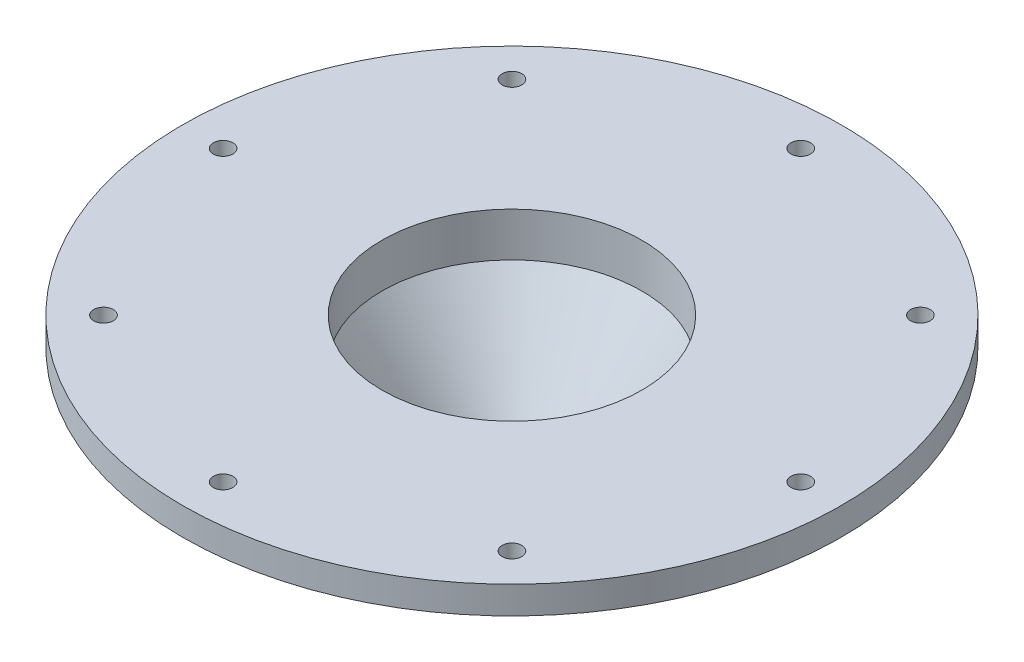
ISO-10303-21;
HEADER;
FILE_DESCRIPTION(('STEP AP214'),'2;1');
FILE_NAME('part.step','',(''),(''),'','','');
FILE_SCHEMA(('AUTOMOTIVE_DESIGN { 1 0 10303 214 1 1 1 1 }'));
ENDSEC;
DATA;
#1=APPLICATION_CONTEXT('core data for automotive mechanical design processes');
#2=APPLICATION_PROTOCOL_DEFINITION('international standard','automotive_design',2000,#1);
#3=PRODUCT_CONTEXT('',#1,'mechanical');
#4=PRODUCT('Part','Part','',(#3));
#5=PRODUCT_RELATED_PRODUCT_CATEGORY('part','',(#4));
#6=PRODUCT_DEFINITION_FORMATION('','',#4);
#7=PRODUCT_DEFINITION_CONTEXT('part definition',#1,'design');
#8=PRODUCT_DEFINITION('design','',#6,#7);
#9=PRODUCT_DEFINITION_SHAPE('','',#8);
#10=(LENGTH_UNIT() NAMED_UNIT(*) SI_UNIT(.MILLI.,.METRE.));
#11=(NAMED_UNIT(*) PLANE_ANGLE_UNIT() SI_UNIT($,.RADIAN.));
#12=(NAMED_UNIT(*) SI_UNIT($,.STERADIAN.) SOLID_ANGLE_UNIT());
#13=UNCERTAINTY_MEASURE_WITH_UNIT(LENGTH_MEASURE(1.E-05),#10,'distance_accuracy_value','');
#14=(GEOMETRIC_REPRESENTATION_CONTEXT(3) GLOBAL_UNCERTAINTY_ASSIGNED_CONTEXT((#13)) GLOBAL_UNIT_ASSIGNED_CONTEXT((#10,
#11,#12)) REPRESENTATION_CONTEXT('',''));
#15=CARTESIAN_POINT('',(0.,0.,0.));
#16=DIRECTION('',(0.,0.,1.));
#17=DIRECTION('',(1.,0.,0.));
#18=AXIS2_PLACEMENT_3D('',#15,#16,#17);
#19=CARTESIAN_POINT('',(0.,-19.05,0.));
#20=DIRECTION('',(0.,-1.,0.));
#21=DIRECTION('',(0.,0.,-1.));
#22=AXIS2_PLACEMENT_3D('',#19,#20,#21);
#23=PLANE('',#22);
#24=CARTESIAN_POINT('',(0.,-19.05,0.));
#25=DIRECTION('',(0.,-1.,0.));
#26=DIRECTION('',(0.,0.,-1.));
#27=AXIS2_PLACEMENT_3D('',#24,#25,#26);
#28=CIRCLE('',#27,5.);
#29=CARTESIAN_POINT('',(0.,-19.05,-5.));
#30=VERTEX_POINT('',#29);
#31=EDGE_CURVE('E55',#30,#30,#28,.T.);
#32=ORIENTED_EDGE('',*,*,#31,.F.);
#33=EDGE_LOOP('',(#32));
#34=FACE_BOUND('',#33,.T.);
#35=CARTESIAN_POINT('',(0.,-19.05,0.));
#36=DIRECTION('',(0.,1.,0.));
#37=DIRECTION('',(-1.,0.,0.));
#38=AXIS2_PLACEMENT_3D('',#35,#36,#37);
#39=CIRCLE('',#38,8.41515202607263);
#40=CARTESIAN_POINT('',(-8.41515202607263,-19.05,0.));
#41=VERTEX_POINT('',#40);
#42=EDGE_CURVE('E165',#41,#41,#39,.T.);
#43=ORIENTED_EDGE('',*,*,#42,.F.);
#44=EDGE_LOOP('',(#43));
#45=FACE_BOUND('',#44,.T.);
#46=ADVANCED_FACE('F36',(#34,#45),#23,.T.);
#47=CARTESIAN_POINT('',(0.,3.175,0.));
#48=DIRECTION('',(0.,-1.,0.));
#49=DIRECTION('',(0.,0.,-1.));
#50=AXIS2_PLACEMENT_3D('',#47,#48,#49);
#51=CYLINDRICAL_SURFACE('',#50,5.);
#52=CARTESIAN_POINT('',(0.,-15.875,0.));
#53=DIRECTION('',(0.,-1.,0.));
#54=DIRECTION('',(0.,0.,-1.));
#55=AXIS2_PLACEMENT_3D('',#52,#53,#54);
#56=CIRCLE('',#55,5.);
#57=CARTESIAN_POINT('',(-1.36585362623204,-15.875,4.80982784221107));
#58=VERTEX_POINT('',#57);
#59=EDGE_CURVE('E64',#58,#58,#56,.T.);
#60=ORIENTED_EDGE('',*,*,#59,.F.);
#61=EDGE_LOOP('',(#60));
#62=FACE_BOUND('',#61,.T.);
#63=ORIENTED_EDGE('',*,*,#31,.T.);
#64=EDGE_LOOP('',(#63));
#65=FACE_BOUND('',#64,.T.);
#66=ADVANCED_FACE('F70',(#62,#65),#51,.F.);
#67=CARTESIAN_POINT('',(0.,0.,0.));
#68=DIRECTION('',(0.,1.,0.));
#69=DIRECTION('',(0.,0.,1.));
#70=AXIS2_PLACEMENT_3D('',#67,#68,#69);
#71=PLANE('',#70);
#72=CARTESIAN_POINT('',(-23.5731723178062,0.,23.5731723178068));
#73=DIRECTION('',(0.,-1.,0.));
#74=DIRECTION('',(0.,0.,-1.));
#75=AXIS2_PLACEMENT_3D('',#72,#73,#74);
#76=CIRCLE('',#75,1.13029999999999);
#77=CARTESIAN_POINT('',(-23.5731723178062,0.,22.4428723178068));
#78=VERTEX_POINT('',#77);
#79=EDGE_CURVE('E58',#78,#78,#76,.T.);
#80=ORIENTED_EDGE('',*,*,#79,.F.);
#81=EDGE_LOOP('',(#80));
#82=FACE_BOUND('',#81,.T.);
#83=CARTESIAN_POINT('',(-33.3375,0.,3.49191777401049E-13));
#84=DIRECTION('',(0.,-1.,0.));
#85=DIRECTION('',(0.,0.,-1.));
#86=AXIS2_PLACEMENT_3D('',#83,#84,#85);
#87=CIRCLE('',#86,1.13029999999999);
#88=CARTESIAN_POINT('',(-33.3375,0.,-1.13029999999964));
#89=VERTEX_POINT('',#88);
#90=EDGE_CURVE('E134',#89,#89,#87,.T.);
#91=ORIENTED_EDGE('',*,*,#90,.F.);
#92=EDGE_LOOP('',(#91));
#93=FACE_BOUND('',#92,.T.);
#94=CARTESIAN_POINT('',(0.,0.,-33.3375));
#95=DIRECTION('',(0.,-1.,0.));
#96=DIRECTION('',(0.,0.,-1.));
#97=AXIS2_PLACEMENT_3D('',#94,#95,#96);
#98=CIRCLE('',#97,1.13029999999999);
#99=CARTESIAN_POINT('',(0.,0.,-34.4678));
#100=VERTEX_POINT('',#99);
#101=EDGE_CURVE('E138',#100,#100,#98,.T.);
#102=ORIENTED_EDGE('',*,*,#101,.F.);
#103=EDGE_LOOP('',(#102));
#104=FACE_BOUND('',#103,.T.);
#105=CARTESIAN_POINT('',(23.5731723178064,0.,-23.5731723178067));
#106=DIRECTION('',(0.,-1.,0.));
#107=DIRECTION('',(0.,0.,-1.));
#108=AXIS2_PLACEMENT_3D('',#105,#106,#107);
#109=CIRCLE('',#108,1.13029999999999);
#110=CARTESIAN_POINT('',(23.5731723178064,0.,-24.7034723178066));
#111=VERTEX_POINT('',#110);
#112=EDGE_CURVE('E142',#111,#111,#109,.T.);
#113=ORIENTED_EDGE('',*,*,#112,.F.);
#114=EDGE_LOOP('',(#113));
#115=FACE_BOUND('',#114,.T.);
#116=CARTESIAN_POINT('',(33.3375,0.,-1.16397259133683E-13));
#117=DIRECTION('',(0.,-1.,0.));
#118=DIRECTION('',(0.,0.,-1.));
#119=AXIS2_PLACEMENT_3D('',#116,#117,#118);
#120=CIRCLE('',#119,1.13029999999999);
#121=CARTESIAN_POINT('',(33.3375,0.,-1.1303000000001));
#122=VERTEX_POINT('',#121);
#123=EDGE_CURVE('E146',#122,#122,#120,.T.);
#124=ORIENTED_EDGE('',*,*,#123,.F.);
#125=EDGE_LOOP('',(#124));
#126=FACE_BOUND('',#125,.T.);
#127=CARTESIAN_POINT('',(23.5731723178066,0.,23.5731723178065));
#128=DIRECTION('',(0.,-1.,0.));
#129=DIRECTION('',(0.,0.,-1.));
#130=AXIS2_PLACEMENT_3D('',#127,#128,#129);
#131=CIRCLE('',#130,1.13029999999999);
#132=CARTESIAN_POINT('',(23.5731723178066,0.,22.4428723178065));
#133=VERTEX_POINT('',#132);
#134=EDGE_CURVE('E150',#133,#133,#131,.T.);
#135=ORIENTED_EDGE('',*,*,#134,.F.);
#136=EDGE_LOOP('',(#135));
#137=FACE_BOUND('',#136,.T.);
#138=CARTESIAN_POINT('',(0.,0.,33.3375));
#139=DIRECTION('',(0.,-1.,0.));
#140=DIRECTION('',(0.,0.,-1.));
#141=AXIS2_PLACEMENT_3D('',#138,#139,#140);
#142=CIRCLE('',#141,1.13029999999999);
#143=CARTESIAN_POINT('',(0.,0.,32.2072));
#144=VERTEX_POINT('',#143);
#145=EDGE_CURVE('E154',#144,#144,#142,.T.);
#146=ORIENTED_EDGE('',*,*,#145,.F.);
#147=EDGE_LOOP('',(#146));
#148=FACE_BOUND('',#147,.T.);
#149=CARTESIAN_POINT('',(0.,0.,0.));
#150=DIRECTION('',(0.,1.,0.));
#151=DIRECTION('',(0.,0.,1.));
#152=AXIS2_PLACEMENT_3D('',#149,#150,#151);
#153=CIRCLE('',#152,38.04031);
#154=CARTESIAN_POINT('',(0.,0.,38.04031));
#155=VERTEX_POINT('',#154);
#156=EDGE_CURVE('E45',#155,#155,#153,.T.);
#157=ORIENTED_EDGE('',*,*,#156,.F.);
#158=EDGE_LOOP('',(#157));
#159=FACE_BOUND('',#158,.T.);
#160=CARTESIAN_POINT('',(-23.5731723178067,0.,-23.5731723178063));
#161=DIRECTION('',(0.,-1.,0.));
#162=DIRECTION('',(0.,0.,-1.));
#163=AXIS2_PLACEMENT_3D('',#160,#161,#162);
#164=CIRCLE('',#163,1.13029999999999);
#165=CARTESIAN_POINT('',(-23.5731723178067,0.,-24.7034723178063));
#166=VERTEX_POINT('',#165);
#167=EDGE_CURVE('E160',#166,#166,#164,.T.);
#168=ORIENTED_EDGE('',*,*,#167,.F.);
#169=EDGE_LOOP('',(#168));
#170=FACE_BOUND('',#169,.T.);
#171=CARTESIAN_POINT('',(0.,0.,0.));
#172=DIRECTION('',(0.,1.,0.));
#173=DIRECTION('',(-1.,0.,0.));
#174=AXIS2_PLACEMENT_3D('',#171,#172,#173);
#175=CIRCLE('',#174,24.4);
#176=CARTESIAN_POINT('',(-24.4,0.,0.));
#177=VERTEX_POINT('',#176);
#178=EDGE_CURVE('E163',#177,#177,#175,.T.);
#179=ORIENTED_EDGE('',*,*,#178,.T.);
#180=EDGE_LOOP('',(#179));
#181=FACE_BOUND('',#180,.T.);
#182=ADVANCED_FACE('F80',(#82,#93,#104,#115,#126,#137,#148,#159,#170,#181),#71,.F.);
#183=CARTESIAN_POINT('',(0.,3.175,0.));
#184=DIRECTION('',(0.,-1.,0.));
#185=DIRECTION('',(0.,0.,-1.));
#186=AXIS2_PLACEMENT_3D('',#183,#184,#185);
#187=CYLINDRICAL_SURFACE('',#186,38.04031);
#188=CARTESIAN_POINT('',(0.,3.175,0.));
#189=DIRECTION('',(0.,1.,0.));
#190=DIRECTION('',(0.,0.,1.));
#191=AXIS2_PLACEMENT_3D('',#188,#189,#190);
#192=CIRCLE('',#191,38.04031);
#193=CARTESIAN_POINT('',(0.,3.175,38.04031));
#194=VERTEX_POINT('',#193);
#195=EDGE_CURVE('E11',#194,#194,#192,.T.);
#196=ORIENTED_EDGE('',*,*,#195,.F.);
#197=EDGE_LOOP('',(#196));
#198=FACE_BOUND('',#197,.T.);
#199=ORIENTED_EDGE('',*,*,#156,.T.);
#200=EDGE_LOOP('',(#199));
#201=FACE_BOUND('',#200,.T.);
#202=ADVANCED_FACE('F38',(#198,#201),#187,.T.);
#203=CARTESIAN_POINT('',(0.,3.175,0.));
#204=DIRECTION('',(0.,1.,0.));
#205=DIRECTION('',(0.,0.,1.));
#206=AXIS2_PLACEMENT_3D('',#203,#204,#205);
#207=PLANE('',#206);
#208=CARTESIAN_POINT('',(0.,3.175,0.));
#209=DIRECTION('',(0.,1.,0.));
#210=DIRECTION('',(0.,0.,1.));
#211=AXIS2_PLACEMENT_3D('',#208,#209,#210);
#212=CIRCLE('',#211,15.);
#213=CARTESIAN_POINT('',(0.,3.175,15.));
#214=VERTEX_POINT('',#213);
#215=EDGE_CURVE('E59',#214,#214,#212,.T.);
#216=ORIENTED_EDGE('',*,*,#215,.F.);
#217=EDGE_LOOP('',(#216));
#218=FACE_BOUND('',#217,.T.);
#219=CARTESIAN_POINT('',(-23.5731723178062,3.175,23.5731723178068));
#220=DIRECTION('',(0.,-1.,0.));
#221=DIRECTION('',(0.,0.,-1.));
#222=AXIS2_PLACEMENT_3D('',#219,#220,#221);
#223=CIRCLE('',#222,1.1303);
#224=CARTESIAN_POINT('',(-23.5731723178062,3.175,22.4428723178068));
#225=VERTEX_POINT('',#224);
#226=EDGE_CURVE('E210',#225,#225,#223,.T.);
#227=ORIENTED_EDGE('',*,*,#226,.T.);
#228=EDGE_LOOP('',(#227));
#229=FACE_BOUND('',#228,.T.);
#230=CARTESIAN_POINT('',(-33.3375,3.175,3.49191777401049E-13));
#231=DIRECTION('',(0.,-1.,0.));
#232=DIRECTION('',(0.,0.,-1.));
#233=AXIS2_PLACEMENT_3D('',#230,#231,#232);
#234=CIRCLE('',#233,1.1303);
#235=CARTESIAN_POINT('',(-33.3375,3.175,-1.13029999999965));
#236=VERTEX_POINT('',#235);
#237=EDGE_CURVE('E214',#236,#236,#234,.T.);
#238=ORIENTED_EDGE('',*,*,#237,.T.);
#239=EDGE_LOOP('',(#238));
#240=FACE_BOUND('',#239,.T.);
#241=CARTESIAN_POINT('',(-23.5731723178067,3.175,-23.5731723178063));
#242=DIRECTION('',(0.,-1.,0.));
#243=DIRECTION('',(0.,0.,-1.));
#244=AXIS2_PLACEMENT_3D('',#241,#242,#243);
#245=CIRCLE('',#244,1.1303);
#246=CARTESIAN_POINT('',(-23.5731723178067,3.175,-24.7034723178063));
#247=VERTEX_POINT('',#246);
#248=EDGE_CURVE('E218',#247,#247,#245,.T.);
#249=ORIENTED_EDGE('',*,*,#248,.T.);
#250=EDGE_LOOP('',(#249));
#251=FACE_BOUND('',#250,.T.);
#252=CARTESIAN_POINT('',(0.,3.175,-33.3375));
#253=DIRECTION('',(0.,-1.,0.));
#254=DIRECTION('',(0.,0.,-1.));
#255=AXIS2_PLACEMENT_3D('',#252,#253,#254);
#256=CIRCLE('',#255,1.1303);
#257=CARTESIAN_POINT('',(0.,3.175,-34.4678));
#258=VERTEX_POINT('',#257);
#259=EDGE_CURVE('E222',#258,#258,#256,.T.);
#260=ORIENTED_EDGE('',*,*,#259,.T.);
#261=EDGE_LOOP('',(#260));
#262=FACE_BOUND('',#261,.T.);
#263=CARTESIAN_POINT('',(23.5731723178064,3.175,-23.5731723178067));
#264=DIRECTION('',(0.,-1.,0.));
#265=DIRECTION('',(0.,0.,-1.));
#266=AXIS2_PLACEMENT_3D('',#263,#264,#265);
#267=CIRCLE('',#266,1.1303);
#268=CARTESIAN_POINT('',(23.5731723178064,3.175,-24.7034723178067));
#269=VERTEX_POINT('',#268);
#270=EDGE_CURVE('E226',#269,#269,#267,.T.);
#271=ORIENTED_EDGE('',*,*,#270,.T.);
#272=EDGE_LOOP('',(#271));
#273=FACE_BOUND('',#272,.T.);
#274=CARTESIAN_POINT('',(33.3375,3.175,-1.16397259133683E-13));
#275=DIRECTION('',(0.,-1.,0.));
#276=DIRECTION('',(0.,0.,-1.));
#277=AXIS2_PLACEMENT_3D('',#274,#275,#276);
#278=CIRCLE('',#277,1.1303);
#279=CARTESIAN_POINT('',(33.3375,3.175,-1.13030000000012));
#280=VERTEX_POINT('',#279);
#281=EDGE_CURVE('E230',#280,#280,#278,.T.);
#282=ORIENTED_EDGE('',*,*,#281,.T.);
#283=EDGE_LOOP('',(#282));
#284=FACE_BOUND('',#283,.T.);
#285=CARTESIAN_POINT('',(23.5731723178066,3.175,23.5731723178065));
#286=DIRECTION('',(0.,-1.,0.));
#287=DIRECTION('',(0.,0.,-1.));
#288=AXIS2_PLACEMENT_3D('',#285,#286,#287);
#289=CIRCLE('',#288,1.1303);
#290=CARTESIAN_POINT('',(23.5731723178066,3.175,22.4428723178065));
#291=VERTEX_POINT('',#290);
#292=EDGE_CURVE('E234',#291,#291,#289,.T.);
#293=ORIENTED_EDGE('',*,*,#292,.T.);
#294=EDGE_LOOP('',(#293));
#295=FACE_BOUND('',#294,.T.);
#296=CARTESIAN_POINT('',(0.,3.175,33.3375));
#297=DIRECTION('',(0.,-1.,0.));
#298=DIRECTION('',(0.,0.,-1.));
#299=AXIS2_PLACEMENT_3D('',#296,#297,#298);
#300=CIRCLE('',#299,1.1303);
#301=CARTESIAN_POINT('',(0.,3.175,32.2072));
#302=VERTEX_POINT('',#301);
#303=EDGE_CURVE('E50',#302,#302,#300,.T.);
#304=ORIENTED_EDGE('',*,*,#303,.T.);
#305=EDGE_LOOP('',(#304));
#306=FACE_BOUND('',#305,.T.);
#307=ORIENTED_EDGE('',*,*,#195,.T.);
#308=EDGE_LOOP('',(#307));
#309=FACE_BOUND('',#308,.T.);
#310=ADVANCED_FACE('F118',(#218,#229,#240,#251,#262,#273,#284,#295,#306,#309),#207,.T.);
#311=CARTESIAN_POINT('',(0.,0.,33.3375));
#312=DIRECTION('',(0.,-1.,0.));
#313=DIRECTION('',(0.,0.,-1.));
#314=AXIS2_PLACEMENT_3D('',#311,#312,#313);
#315=CYLINDRICAL_SURFACE('',#314,1.13029999999999);
#316=ORIENTED_EDGE('',*,*,#303,.F.);
#317=EDGE_LOOP('',(#316));
#318=FACE_BOUND('',#317,.T.);
#319=ORIENTED_EDGE('',*,*,#145,.T.);
#320=EDGE_LOOP('',(#319));
#321=FACE_BOUND('',#320,.T.);
#322=ADVANCED_FACE('F114',(#318,#321),#315,.F.);
#323=CARTESIAN_POINT('',(23.5731723178066,0.,23.5731723178065));
#324=DIRECTION('',(0.,-1.,0.));
#325=DIRECTION('',(0.,0.,-1.));
#326=AXIS2_PLACEMENT_3D('',#323,#324,#325);
#327=CYLINDRICAL_SURFACE('',#326,1.13029999999999);
#328=ORIENTED_EDGE('',*,*,#292,.F.);
#329=EDGE_LOOP('',(#328));
#330=FACE_BOUND('',#329,.T.);
#331=ORIENTED_EDGE('',*,*,#134,.T.);
#332=EDGE_LOOP('',(#331));
#333=FACE_BOUND('',#332,.T.);
#334=ADVANCED_FACE('F110',(#330,#333),#327,.F.);
#335=CARTESIAN_POINT('',(33.3375,0.,-1.16397259133683E-13));
#336=DIRECTION('',(0.,-1.,0.));
#337=DIRECTION('',(0.,0.,-1.));
#338=AXIS2_PLACEMENT_3D('',#335,#336,#337);
#339=CYLINDRICAL_SURFACE('',#338,1.13029999999999);
#340=ORIENTED_EDGE('',*,*,#281,.F.);
#341=EDGE_LOOP('',(#340));
#342=FACE_BOUND('',#341,.T.);
#343=ORIENTED_EDGE('',*,*,#123,.T.);
#344=EDGE_LOOP('',(#343));
#345=FACE_BOUND('',#344,.T.);
#346=ADVANCED_FACE('F106',(#342,#345),#339,.F.);
#347=CARTESIAN_POINT('',(23.5731723178064,0.,-23.5731723178067));
#348=DIRECTION('',(0.,-1.,0.));
#349=DIRECTION('',(0.,0.,-1.));
#350=AXIS2_PLACEMENT_3D('',#347,#348,#349);
#351=CYLINDRICAL_SURFACE('',#350,1.13029999999999);
#352=ORIENTED_EDGE('',*,*,#270,.F.);
#353=EDGE_LOOP('',(#352));
#354=FACE_BOUND('',#353,.T.);
#355=ORIENTED_EDGE('',*,*,#112,.T.);
#356=EDGE_LOOP('',(#355));
#357=FACE_BOUND('',#356,.T.);
#358=ADVANCED_FACE('F102',(#354,#357),#351,.F.);
#359=CARTESIAN_POINT('',(0.,0.,-33.3375));
#360=DIRECTION('',(0.,-1.,0.));
#361=DIRECTION('',(0.,0.,-1.));
#362=AXIS2_PLACEMENT_3D('',#359,#360,#361);
#363=CYLINDRICAL_SURFACE('',#362,1.13029999999999);
#364=ORIENTED_EDGE('',*,*,#259,.F.);
#365=EDGE_LOOP('',(#364));
#366=FACE_BOUND('',#365,.T.);
#367=ORIENTED_EDGE('',*,*,#101,.T.);
#368=EDGE_LOOP('',(#367));
#369=FACE_BOUND('',#368,.T.);
#370=ADVANCED_FACE('F98',(#366,#369),#363,.F.);
#371=CARTESIAN_POINT('',(-23.5731723178067,0.,-23.5731723178063));
#372=DIRECTION('',(0.,-1.,0.));
#373=DIRECTION('',(0.,0.,-1.));
#374=AXIS2_PLACEMENT_3D('',#371,#372,#373);
#375=CYLINDRICAL_SURFACE('',#374,1.13029999999999);
#376=ORIENTED_EDGE('',*,*,#248,.F.);
#377=EDGE_LOOP('',(#376));
#378=FACE_BOUND('',#377,.T.);
#379=ORIENTED_EDGE('',*,*,#167,.T.);
#380=EDGE_LOOP('',(#379));
#381=FACE_BOUND('',#380,.T.);
#382=ADVANCED_FACE('F94',(#378,#381),#375,.F.);
#383=CARTESIAN_POINT('',(-33.3375,0.,3.49191777401049E-13));
#384=DIRECTION('',(0.,-1.,0.));
#385=DIRECTION('',(0.,0.,-1.));
#386=AXIS2_PLACEMENT_3D('',#383,#384,#385);
#387=CYLINDRICAL_SURFACE('',#386,1.13029999999999);
#388=ORIENTED_EDGE('',*,*,#237,.F.);
#389=EDGE_LOOP('',(#388));
#390=FACE_BOUND('',#389,.T.);
#391=ORIENTED_EDGE('',*,*,#90,.T.);
#392=EDGE_LOOP('',(#391));
#393=FACE_BOUND('',#392,.T.);
#394=ADVANCED_FACE('F90',(#390,#393),#387,.F.);
#395=CARTESIAN_POINT('',(-23.5731723178062,0.,23.5731723178068));
#396=DIRECTION('',(0.,-1.,0.));
#397=DIRECTION('',(0.,0.,-1.));
#398=AXIS2_PLACEMENT_3D('',#395,#396,#397);
#399=CYLINDRICAL_SURFACE('',#398,1.13029999999999);
#400=ORIENTED_EDGE('',*,*,#226,.F.);
#401=EDGE_LOOP('',(#400));
#402=FACE_BOUND('',#401,.T.);
#403=ORIENTED_EDGE('',*,*,#79,.T.);
#404=EDGE_LOOP('',(#403));
#405=FACE_BOUND('',#404,.T.);
#406=ADVANCED_FACE('F87',(#402,#405),#399,.F.);
#407=CARTESIAN_POINT('',(0.,-1.905,0.));
#408=DIRECTION('',(0.,1.,0.));
#409=DIRECTION('',(0.,0.,1.));
#410=AXIS2_PLACEMENT_3D('',#407,#408,#409);
#411=CYLINDRICAL_SURFACE('',#410,15.);
#412=CARTESIAN_POINT('',(0.,-1.905,0.));
#413=DIRECTION('',(0.,1.,0.));
#414=DIRECTION('',(0.,0.,1.));
#415=AXIS2_PLACEMENT_3D('',#412,#413,#414);
#416=CIRCLE('',#415,15.);
#417=CARTESIAN_POINT('',(0.,-1.905,15.));
#418=VERTEX_POINT('',#417);
#419=EDGE_CURVE('E40',#418,#418,#416,.T.);
#420=ORIENTED_EDGE('',*,*,#419,.F.);
#421=EDGE_LOOP('',(#420));
#422=FACE_BOUND('',#421,.T.);
#423=ORIENTED_EDGE('',*,*,#215,.T.);
#424=EDGE_LOOP('',(#423));
#425=FACE_BOUND('',#424,.T.);
#426=ADVANCED_FACE('F81',(#422,#425),#411,.F.);
#427=CARTESIAN_POINT('',(0.,-1.905,15.));
#428=CARTESIAN_POINT('',(-1.36585362623204,-15.875,4.80982784221107));
#429=CARTESIAN_POINT('',(-30.,-1.905,15.));
#430=CARTESIAN_POINT('',(-10.9855093106542,-15.875,2.07812058974699));
#431=CARTESIAN_POINT('',(-30.,-1.905,-15.));
#432=CARTESIAN_POINT('',(-8.2538020581901,-15.875,-7.54153509467515));
#433=CARTESIAN_POINT('',(0.,-1.905,-15.));
#434=CARTESIAN_POINT('',(1.36585362623204,-15.875,-4.80982784221107));
#435=CARTESIAN_POINT('',(30.,-1.905,-15.));
#436=CARTESIAN_POINT('',(10.9855093106542,-15.875,-2.07812058974699));
#437=CARTESIAN_POINT('',(30.,-1.905,15.));
#438=CARTESIAN_POINT('',(8.2538020581901,-15.875,7.54153509467515));
#439=CARTESIAN_POINT('',(0.,-1.905,15.));
#440=CARTESIAN_POINT('',(-1.36585362623204,-15.875,4.80982784221107));
#441=(BOUNDED_SURFACE() B_SPLINE_SURFACE(3,1,((#427,#428),(#429,#430),(#431,#432),(#433,#434),
(#435,#436),(#437,#438),(#439,#440)),.UNSPECIFIED.,.T.,.F.,.F.) B_SPLINE_SURFACE_WITH_KNOTS((4,
3,4),(2,2),(0.,0.5,1.),(0.,1.),
.UNSPECIFIED.) GEOMETRIC_REPRESENTATION_ITEM() RATIONAL_B_SPLINE_SURFACE(((1.,1.),
(0.333333333333333,0.333333333333333),(0.333333333333333,0.333333333333333),(1.,1.),
(0.333333333333333,0.333333333333333),(0.333333333333333,0.333333333333333),(1.,1.))) REPRESENTATION_ITEM('') SURFACE());
#442=CARTESIAN_POINT('',(0.,-1.905,15.));
#443=CARTESIAN_POINT('',(-0.0142276419399171,-2.05052083333333,14.8938523733564));
#444=CARTESIAN_POINT('',(-0.0284552838798341,-2.19604166666667,14.7877047467127));
#445=CARTESIAN_POINT('',(-0.0569105677596682,-2.48708333333333,14.5754094934255));
#446=CARTESIAN_POINT('',(-0.0711382096995853,-2.63260416666667,14.4692618667818));
#447=CARTESIAN_POINT('',(-0.0995934935794194,-2.92364583333333,14.2569666134946));
#448=CARTESIAN_POINT('',(-0.113821135519336,-3.06916666666667,14.1508189868509));
#449=CARTESIAN_POINT('',(-0.142276419399171,-3.36020833333333,13.9385237335637));
#450=CARTESIAN_POINT('',(-0.156504061339088,-3.50572916666667,13.83237610692));
#451=CARTESIAN_POINT('',(-0.184959345218922,-3.79677083333333,13.6200808536327));
#452=CARTESIAN_POINT('',(-0.199186987158839,-3.94229166666667,13.5139332269891));
#453=CARTESIAN_POINT('',(-0.227642271038673,-4.23333333333333,13.3016379737018));
#454=CARTESIAN_POINT('',(-0.24186991297859,-4.37885416666667,13.1954903470582));
#455=CARTESIAN_POINT('',(-0.270325196858424,-4.66989583333333,12.9831950937709));
#456=CARTESIAN_POINT('',(-0.284552838798341,-4.81541666666667,12.8770474671273));
#457=CARTESIAN_POINT('',(-0.313008122678175,-5.10645833333333,12.66475221384));
#458=CARTESIAN_POINT('',(-0.327235764618092,-5.25197916666667,12.5586045871964));
#459=CARTESIAN_POINT('',(-0.355691048497926,-5.54302083333333,12.3463093339091));
#460=CARTESIAN_POINT('',(-0.369918690437843,-5.68854166666667,12.2401617072655));
#461=CARTESIAN_POINT('',(-0.398373974317678,-5.97958333333333,12.0278664539782));
#462=CARTESIAN_POINT('',(-0.412601616257595,-6.12510416666667,11.9217188273346));
#463=CARTESIAN_POINT('',(-0.441056900137429,-6.41614583333333,11.7094235740473));
#464=CARTESIAN_POINT('',(-0.455284542077346,-6.56166666666667,11.6032759474037));
#465=CARTESIAN_POINT('',(-0.48373982595718,-6.85270833333333,11.3909806941164));
#466=CARTESIAN_POINT('',(-0.497967467897097,-6.99822916666667,11.2848330674728));
#467=CARTESIAN_POINT('',(-0.526422751776931,-7.28927083333333,11.0725378141855));
#468=CARTESIAN_POINT('',(-0.540650393716848,-7.43479166666667,10.9663901875419));
#469=CARTESIAN_POINT('',(-0.569105677596682,-7.72583333333333,10.7540949342546));
#470=CARTESIAN_POINT('',(-0.583333319536599,-7.87135416666667,10.647947307611));
#471=CARTESIAN_POINT('',(-0.611788603416433,-8.16239583333333,10.4356520543237));
#472=CARTESIAN_POINT('',(-0.626016245356351,-8.30791666666667,10.3295044276801));
#473=CARTESIAN_POINT('',(-0.654471529236185,-8.59895833333333,10.1172091743928));
#474=CARTESIAN_POINT('',(-0.668699171176102,-8.74447916666667,10.0110615477492));
#475=CARTESIAN_POINT('',(-0.697154455055936,-9.03552083333333,9.7987662944619));
#476=CARTESIAN_POINT('',(-0.711382096995853,-9.18104166666667,9.69261866781827));
#477=CARTESIAN_POINT('',(-0.739837380875687,-9.47208333333333,9.48032341453099));
#478=CARTESIAN_POINT('',(-0.754065022815604,-9.61760416666667,9.37417578788736));
#479=CARTESIAN_POINT('',(-0.782520306695438,-9.90864583333333,9.16188053460009));
#480=CARTESIAN_POINT('',(-0.796747948635355,-10.0541666666667,9.05573290795646));
#481=CARTESIAN_POINT('',(-0.825203232515189,-10.3452083333333,8.84343765466919));
#482=CARTESIAN_POINT('',(-0.839430874455106,-10.4907291666667,8.73729002802555));
#483=CARTESIAN_POINT('',(-0.867886158334941,-10.7817708333333,8.52499477473828));
#484=CARTESIAN_POINT('',(-0.882113800274858,-10.9272916666667,8.41884714809465));
#485=CARTESIAN_POINT('',(-0.910569084154692,-11.2183333333333,8.20655189480738));
#486=CARTESIAN_POINT('',(-0.924796726094609,-11.3638541666667,8.10040426816374));
#487=CARTESIAN_POINT('',(-0.953252009974443,-11.6548958333333,7.88810901487648));
#488=CARTESIAN_POINT('',(-0.96747965191436,-11.8004166666667,7.78196138823284));
#489=CARTESIAN_POINT('',(-0.995934935794194,-12.0914583333333,7.56966613494557));
#490=CARTESIAN_POINT('',(-1.01016257773411,-12.2369791666667,7.46351850830194));
#491=CARTESIAN_POINT('',(-1.03861786161395,-12.5280208333333,7.25122325501467));
#492=CARTESIAN_POINT('',(-1.05284550355386,-12.6735416666667,7.14507562837103));
#493=CARTESIAN_POINT('',(-1.0813007874337,-12.9645833333333,6.93278037508376));
#494=CARTESIAN_POINT('',(-1.09552842937361,-13.1101041666667,6.82663274844013));
#495=CARTESIAN_POINT('',(-1.12398371325345,-13.4011458333333,6.61433749515286));
#496=CARTESIAN_POINT('',(-1.13821135519336,-13.5466666666667,6.50818986850923));
#497=CARTESIAN_POINT('',(-1.1666666390732,-13.8377083333333,6.29589461522196));
#498=CARTESIAN_POINT('',(-1.18089428101312,-13.9832291666667,6.18974698857832));
#499=CARTESIAN_POINT('',(-1.20934956489295,-14.2742708333333,5.97745173529105));
#500=CARTESIAN_POINT('',(-1.22357720683287,-14.4197916666667,5.87130410864742));
#501=CARTESIAN_POINT('',(-1.2520324907127,-14.7108333333333,5.65900885536015));
#502=CARTESIAN_POINT('',(-1.26626013265262,-14.8563541666667,5.55286122871651));
#503=CARTESIAN_POINT('',(-1.29471541653245,-15.1473958333333,5.34056597542924));
#504=CARTESIAN_POINT('',(-1.30894305847237,-15.2929166666667,5.23441834878561));
#505=CARTESIAN_POINT('',(-1.3373983423522,-15.5839583333333,5.02212309549834));
#506=CARTESIAN_POINT('',(-1.35162598429212,-15.7294791666667,4.9159754688547));
#507=CARTESIAN_POINT('',(-1.36585362623204,-15.875,4.80982784221107));
#508=B_SPLINE_CURVE_WITH_KNOTS('',3,(#442,#443,#444,#445,#446,#447,#448,#449,#450,#451,#452,
#453,#454,#455,#456,#457,#458,#459,#460,#461,#462,#463,#464,#465,#466,#467,#468,#469,#470,#471,
#472,#473,#474,#475,#476,#477,#478,#479,#480,#481,#482,#483,#484,#485,#486,#487,#488,#489,#490,
#491,#492,#493,#494,#495,#496,#497,#498,#499,#500,#501,#502,#503,#504,#505,#506,#507),
.UNSPECIFIED.,.F.,.F.,(4,2,2,2,2,2,2,2,2,2,2,2,2,2,2,2,2,2,2,2,2,2,2,2,2,2,2,2,2,2,2,2,4),(0.,
0.542046599787761,1.08409319957552,1.62613979936328,2.16818639915104,2.7102329989388,
3.25227959872656,3.79432619851432,4.33637279830208,4.87841939808984,5.42046599787761,
5.96251259766536,6.50455919745313,7.04660579724089,7.58865239702865,8.13069899681641,
8.67274559660417,9.21479219639193,9.75683879617969,10.2988853959674,10.8409319957552,
11.382978595543,11.9250251953307,12.4670717951185,13.0091183949063,13.551164994694,
14.0932115944818,14.6352581942695,15.1773047940573,15.7193513938451,16.2613979936328,
16.8034445934206,17.3454911932083),.UNSPECIFIED.);
#509=EDGE_CURVE('BSEAM177',#418,#58,#508,.T.);
#510=ORIENTED_EDGE('',*,*,#419,.T.);
#511=ORIENTED_EDGE('',*,*,#59,.T.);
#512=ORIENTED_EDGE('',*,*,#509,.T.);
#513=ORIENTED_EDGE('',*,*,#509,.F.);
#514=EDGE_LOOP('',(#510,#512,#511,#513));
#515=FACE_BOUND('',#514,.T.);
#516=ADVANCED_FACE('F177',(#515),#441,.F.);
#517=CARTESIAN_POINT('',(0.,0.,0.));
#518=DIRECTION('',(0.,1.,0.));
#519=DIRECTION('',(-1.,0.,0.));
#520=AXIS2_PLACEMENT_3D('',#517,#518,#519);
#521=CONICAL_SURFACE('',#520,24.4,0.698131700797738);
#522=ORIENTED_EDGE('',*,*,#42,.T.);
#523=EDGE_LOOP('',(#522));
#524=FACE_BOUND('',#523,.T.);
#525=ORIENTED_EDGE('',*,*,#178,.F.);
#526=EDGE_LOOP('',(#525));
#527=FACE_BOUND('',#526,.T.);
#528=ADVANCED_FACE('F188',(#524,#527),#521,.T.);
#529=CLOSED_SHELL('',(#46,#66,#182,#202,#310,#322,#334,#346,#358,#370,#382,#394,#406,#426,#516,#528));
#530=MANIFOLD_SOLID_BREP('B2',#529);
#531=ADVANCED_BREP_SHAPE_REPRESENTATION('',(#18,#530),#14);
#532=SHAPE_DEFINITION_REPRESENTATION(#9,#531);
ENDSEC;
END-ISO-10303-21;
